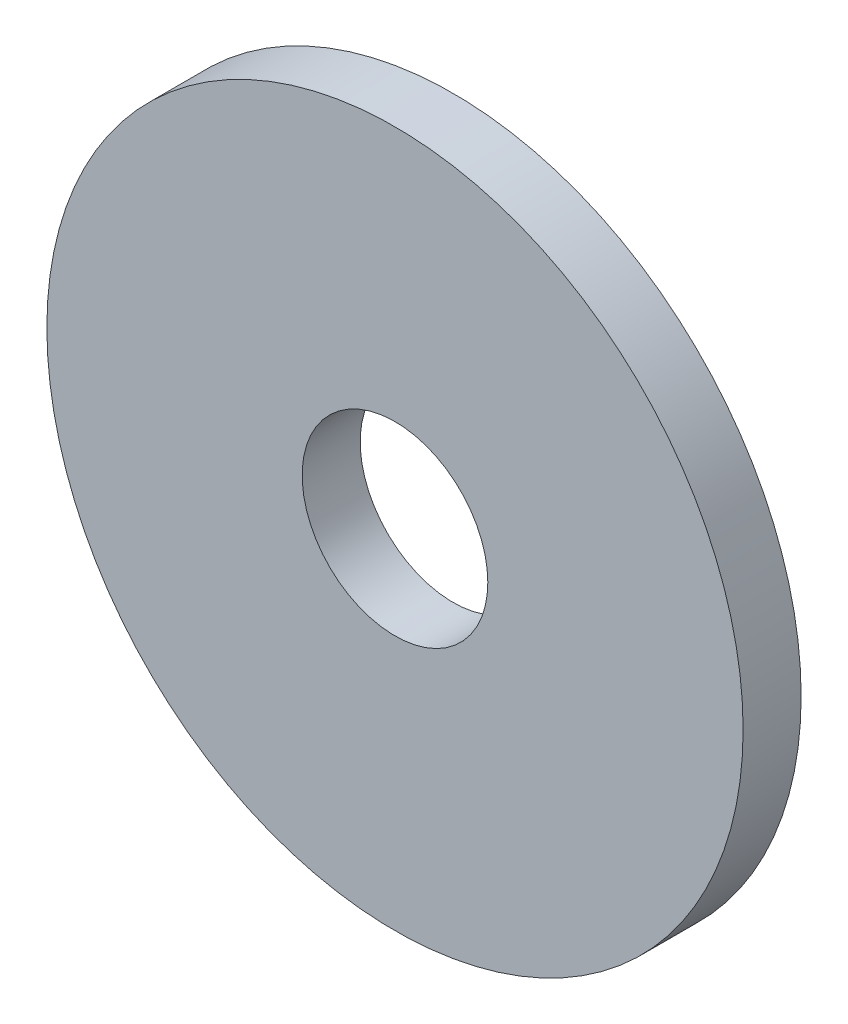
ISO-10303-21;
HEADER;
FILE_DESCRIPTION(('STEP AP214'),'2;1');
FILE_NAME('part.step','',(''),(''),'','','');
FILE_SCHEMA(('AUTOMOTIVE_DESIGN { 1 0 10303 214 1 1 1 1 }'));
ENDSEC;
DATA;
#1=APPLICATION_CONTEXT('core data for automotive mechanical design processes');
#2=APPLICATION_PROTOCOL_DEFINITION('international standard','automotive_design',2000,#1);
#3=PRODUCT_CONTEXT('',#1,'mechanical');
#4=PRODUCT('Part','Part','',(#3));
#5=PRODUCT_RELATED_PRODUCT_CATEGORY('part','',(#4));
#6=PRODUCT_DEFINITION_FORMATION('','',#4);
#7=PRODUCT_DEFINITION_CONTEXT('part definition',#1,'design');
#8=PRODUCT_DEFINITION('design','',#6,#7);
#9=PRODUCT_DEFINITION_SHAPE('','',#8);
#10=(LENGTH_UNIT() NAMED_UNIT(*) SI_UNIT(.MILLI.,.METRE.));
#11=(NAMED_UNIT(*) PLANE_ANGLE_UNIT() SI_UNIT($,.RADIAN.));
#12=(NAMED_UNIT(*) SI_UNIT($,.STERADIAN.) SOLID_ANGLE_UNIT());
#13=UNCERTAINTY_MEASURE_WITH_UNIT(LENGTH_MEASURE(1.E-05),#10,'distance_accuracy_value','');
#14=(GEOMETRIC_REPRESENTATION_CONTEXT(3) GLOBAL_UNCERTAINTY_ASSIGNED_CONTEXT((#13)) GLOBAL_UNIT_ASSIGNED_CONTEXT((#10,
#11,#12)) REPRESENTATION_CONTEXT('',''));
#15=CARTESIAN_POINT('',(0.,0.,0.));
#16=DIRECTION('',(0.,0.,1.));
#17=DIRECTION('',(1.,0.,0.));
#18=AXIS2_PLACEMENT_3D('',#15,#16,#17);
#19=CARTESIAN_POINT('',(0.,0.,1.5875));
#20=DIRECTION('',(0.,0.,1.));
#21=DIRECTION('',(1.,0.,0.));
#22=AXIS2_PLACEMENT_3D('',#19,#20,#21);
#23=PLANE('',#22);
#24=CARTESIAN_POINT('',(0.,0.,1.5875));
#25=DIRECTION('',(0.,0.,1.));
#26=DIRECTION('',(1.,0.,0.));
#27=AXIS2_PLACEMENT_3D('',#24,#25,#26);
#28=CIRCLE('',#27,9.525);
#29=CARTESIAN_POINT('',(9.525,0.,1.5875));
#30=VERTEX_POINT('',#29);
#31=EDGE_CURVE('E10',#30,#30,#28,.T.);
#32=ORIENTED_EDGE('',*,*,#31,.T.);
#33=EDGE_LOOP('',(#32));
#34=FACE_BOUND('',#33,.T.);
#35=CARTESIAN_POINT('',(0.,0.,1.5875));
#36=DIRECTION('',(0.,0.,1.));
#37=DIRECTION('',(1.,0.,0.));
#38=AXIS2_PLACEMENT_3D('',#35,#36,#37);
#39=CIRCLE('',#38,2.54);
#40=CARTESIAN_POINT('',(2.54,0.,1.5875));
#41=VERTEX_POINT('',#40);
#42=EDGE_CURVE('E42',#41,#41,#39,.T.);
#43=ORIENTED_EDGE('',*,*,#42,.F.);
#44=EDGE_LOOP('',(#43));
#45=FACE_BOUND('',#44,.T.);
#46=ADVANCED_FACE('F31',(#34,#45),#23,.T.);
#47=CARTESIAN_POINT('',(0.,0.,0.));
#48=DIRECTION('',(0.,0.,1.));
#49=DIRECTION('',(1.,0.,0.));
#50=AXIS2_PLACEMENT_3D('',#47,#48,#49);
#51=PLANE('',#50);
#52=CARTESIAN_POINT('',(0.,0.,0.));
#53=DIRECTION('',(0.,0.,1.));
#54=DIRECTION('',(1.,0.,0.));
#55=AXIS2_PLACEMENT_3D('',#52,#53,#54);
#56=CIRCLE('',#55,9.525);
#57=CARTESIAN_POINT('',(9.525,0.,0.));
#58=VERTEX_POINT('',#57);
#59=EDGE_CURVE('E35',#58,#58,#56,.T.);
#60=ORIENTED_EDGE('',*,*,#59,.F.);
#61=EDGE_LOOP('',(#60));
#62=FACE_BOUND('',#61,.T.);
#63=CARTESIAN_POINT('',(0.,0.,0.));
#64=DIRECTION('',(0.,0.,1.));
#65=DIRECTION('',(1.,0.,0.));
#66=AXIS2_PLACEMENT_3D('',#63,#64,#65);
#67=CIRCLE('',#66,2.54);
#68=CARTESIAN_POINT('',(2.54,0.,0.));
#69=VERTEX_POINT('',#68);
#70=EDGE_CURVE('E44',#69,#69,#67,.T.);
#71=ORIENTED_EDGE('',*,*,#70,.T.);
#72=EDGE_LOOP('',(#71));
#73=FACE_BOUND('',#72,.T.);
#74=ADVANCED_FACE('F54',(#62,#73),#51,.F.);
#75=CARTESIAN_POINT('',(0.,0.,1.5875));
#76=DIRECTION('',(0.,0.,-1.));
#77=DIRECTION('',(-1.,0.,0.));
#78=AXIS2_PLACEMENT_3D('',#75,#76,#77);
#79=CYLINDRICAL_SURFACE('',#78,9.525);
#80=ORIENTED_EDGE('',*,*,#31,.F.);
#81=EDGE_LOOP('',(#80));
#82=FACE_BOUND('',#81,.T.);
#83=ORIENTED_EDGE('',*,*,#59,.T.);
#84=EDGE_LOOP('',(#83));
#85=FACE_BOUND('',#84,.T.);
#86=ADVANCED_FACE('F33',(#82,#85),#79,.T.);
#87=CARTESIAN_POINT('',(0.,0.,1.5875));
#88=DIRECTION('',(0.,0.,-1.));
#89=DIRECTION('',(-1.,0.,0.));
#90=AXIS2_PLACEMENT_3D('',#87,#88,#89);
#91=CYLINDRICAL_SURFACE('',#90,2.54);
#92=ORIENTED_EDGE('',*,*,#42,.T.);
#93=EDGE_LOOP('',(#92));
#94=FACE_BOUND('',#93,.T.);
#95=ORIENTED_EDGE('',*,*,#70,.F.);
#96=EDGE_LOOP('',(#95));
#97=FACE_BOUND('',#96,.T.);
#98=ADVANCED_FACE('F50',(#94,#97),#91,.F.);
#99=CLOSED_SHELL('',(#46,#74,#86,#98));
#100=MANIFOLD_SOLID_BREP('B2',#99);
#101=ADVANCED_BREP_SHAPE_REPRESENTATION('',(#18,#100),#14);
#102=SHAPE_DEFINITION_REPRESENTATION(#9,#101);
ENDSEC;
END-ISO-10303-21;
